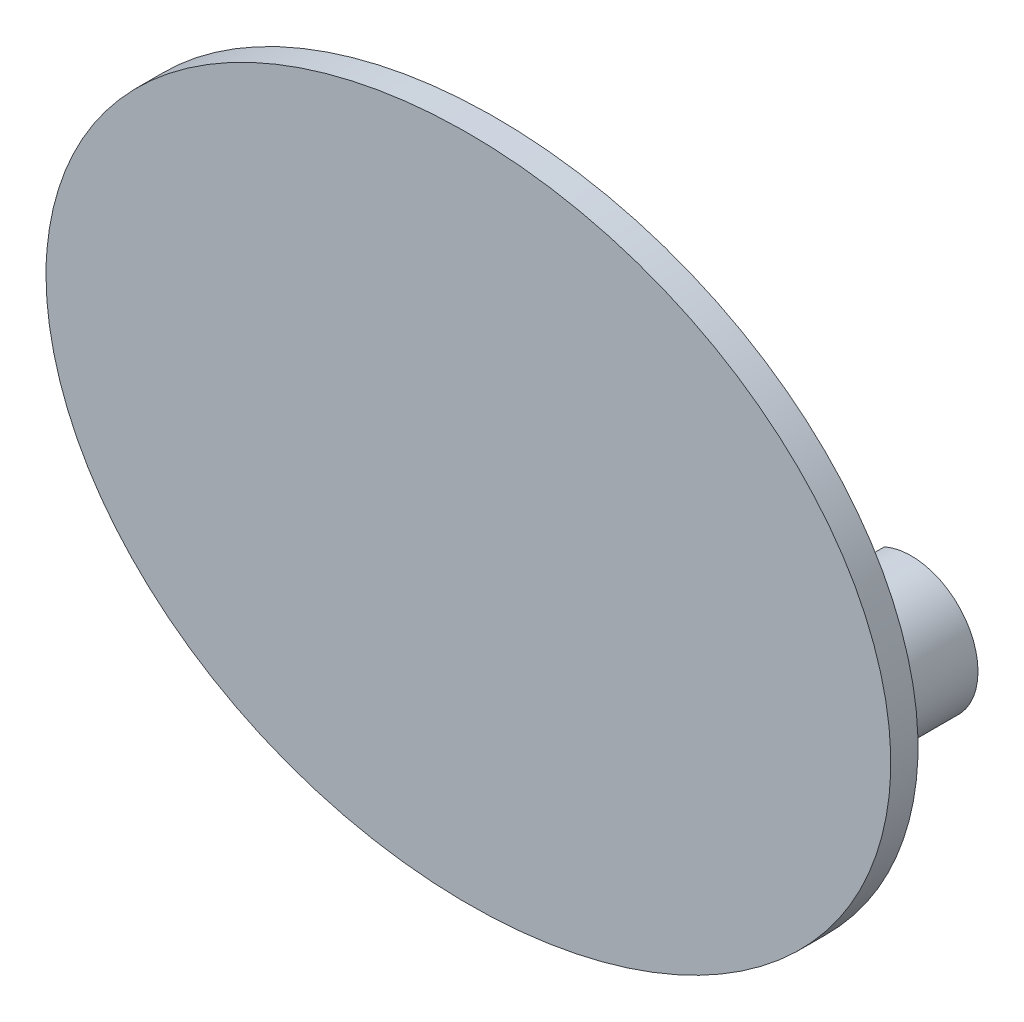
ISO-10303-21;
HEADER;
FILE_DESCRIPTION(('STEP AP214'),'2;1');
FILE_NAME('part.step','',(''),(''),'','','');
FILE_SCHEMA(('AUTOMOTIVE_DESIGN { 1 0 10303 214 1 1 1 1 }'));
ENDSEC;
DATA;
#1=APPLICATION_CONTEXT('core data for automotive mechanical design processes');
#2=APPLICATION_PROTOCOL_DEFINITION('international standard','automotive_design',2000,#1);
#3=PRODUCT_CONTEXT('',#1,'mechanical');
#4=PRODUCT('Part','Part','',(#3));
#5=PRODUCT_RELATED_PRODUCT_CATEGORY('part','',(#4));
#6=PRODUCT_DEFINITION_FORMATION('','',#4);
#7=PRODUCT_DEFINITION_CONTEXT('part definition',#1,'design');
#8=PRODUCT_DEFINITION('design','',#6,#7);
#9=PRODUCT_DEFINITION_SHAPE('','',#8);
#10=(LENGTH_UNIT() NAMED_UNIT(*) SI_UNIT(.MILLI.,.METRE.));
#11=(NAMED_UNIT(*) PLANE_ANGLE_UNIT() SI_UNIT($,.RADIAN.));
#12=(NAMED_UNIT(*) SI_UNIT($,.STERADIAN.) SOLID_ANGLE_UNIT());
#13=UNCERTAINTY_MEASURE_WITH_UNIT(LENGTH_MEASURE(1.E-05),#10,'distance_accuracy_value','');
#14=(GEOMETRIC_REPRESENTATION_CONTEXT(3) GLOBAL_UNCERTAINTY_ASSIGNED_CONTEXT((#13)) GLOBAL_UNIT_ASSIGNED_CONTEXT((#10,
#11,#12)) REPRESENTATION_CONTEXT('',''));
#15=CARTESIAN_POINT('',(0.,0.,0.));
#16=DIRECTION('',(0.,0.,1.));
#17=DIRECTION('',(1.,0.,0.));
#18=AXIS2_PLACEMENT_3D('',#15,#16,#17);
#19=CARTESIAN_POINT('',(0.,0.,-7.));
#20=DIRECTION('',(0.,0.,1.));
#21=DIRECTION('',(1.,0.,0.));
#22=AXIS2_PLACEMENT_3D('',#19,#20,#21);
#23=CYLINDRICAL_SURFACE('',#22,22.);
#24=DIRECTION('',(0.,0.,1.));
#25=VECTOR('',#24,1.);
#26=CARTESIAN_POINT('',(21.9863829787234,-0.773927330504451,-7.));
#27=LINE('',#26,#25);
#28=CARTESIAN_POINT('',(21.9863829787234,-0.773927330504452,-2.9));
#29=VERTEX_POINT('',#28);
#30=CARTESIAN_POINT('',(21.9863829787234,-0.773927330504452,0.));
#31=VERTEX_POINT('',#30);
#32=EDGE_CURVE('E312',#29,#31,#27,.T.);
#33=ORIENTED_EDGE('',*,*,#32,.F.);
#34=CARTESIAN_POINT('',(0.,0.,-2.9));
#35=DIRECTION('',(0.,0.,-1.));
#36=DIRECTION('',(-1.,0.,0.));
#37=AXIS2_PLACEMENT_3D('',#34,#35,#36);
#38=CIRCLE('',#37,22.);
#39=CARTESIAN_POINT('',(21.8080260454723,-2.89999999999999,-2.9));
#40=VERTEX_POINT('',#39);
#41=EDGE_CURVE('E244',#29,#40,#38,.T.);
#42=ORIENTED_EDGE('',*,*,#41,.T.);
#43=DIRECTION('',(0.,0.,1.));
#44=VECTOR('',#43,1.);
#45=CARTESIAN_POINT('',(21.8080260454723,-2.89999999999999,-7.));
#46=LINE('',#45,#44);
#47=CARTESIAN_POINT('',(21.8080260454723,-2.89999999999999,-5.4));
#48=VERTEX_POINT('',#47);
#49=EDGE_CURVE('E191',#48,#40,#46,.T.);
#50=ORIENTED_EDGE('',*,*,#49,.F.);
#51=CARTESIAN_POINT('',(0.,0.,-5.4));
#52=DIRECTION('',(0.,0.,-1.));
#53=DIRECTION('',(-1.,0.,0.));
#54=AXIS2_PLACEMENT_3D('',#51,#52,#53);
#55=CIRCLE('',#54,22.);
#56=CARTESIAN_POINT('',(21.9863829787234,-0.773927330504452,-5.4));
#57=VERTEX_POINT('',#56);
#58=EDGE_CURVE('E230',#57,#48,#55,.T.);
#59=ORIENTED_EDGE('',*,*,#58,.F.);
#60=CARTESIAN_POINT('',(21.9863829787234,-0.773927330504451,-7.));
#61=VERTEX_POINT('',#60);
#62=EDGE_CURVE('E308',#61,#57,#27,.T.);
#63=ORIENTED_EDGE('',*,*,#62,.F.);
#64=CARTESIAN_POINT('',(0.,0.,-7.));
#65=DIRECTION('',(0.,0.,-1.));
#66=DIRECTION('',(1.,0.,0.));
#67=AXIS2_PLACEMENT_3D('',#64,#65,#66);
#68=CIRCLE('',#67,22.);
#69=CARTESIAN_POINT('',(21.5370212765957,-4.48962298322054,-7.));
#70=VERTEX_POINT('',#69);
#71=EDGE_CURVE('E286',#61,#70,#68,.T.);
#72=ORIENTED_EDGE('',*,*,#71,.T.);
#73=DIRECTION('',(0.,0.,1.));
#74=VECTOR('',#73,1.);
#75=CARTESIAN_POINT('',(21.5370212765957,-4.48962298322054,-7.));
#76=LINE('',#75,#74);
#77=CARTESIAN_POINT('',(21.5370212765957,-4.48962298322054,0.));
#78=VERTEX_POINT('',#77);
#79=EDGE_CURVE('E299',#70,#78,#76,.T.);
#80=ORIENTED_EDGE('',*,*,#79,.T.);
#81=CARTESIAN_POINT('',(0.,0.,0.));
#82=DIRECTION('',(0.,0.,-1.));
#83=DIRECTION('',(1.,0.,0.));
#84=AXIS2_PLACEMENT_3D('',#81,#82,#83);
#85=CIRCLE('',#84,22.);
#86=EDGE_CURVE('E275',#31,#78,#85,.T.);
#87=ORIENTED_EDGE('',*,*,#86,.F.);
#88=EDGE_LOOP('',(#33,#42,#50,#59,#63,#72,#80,#87));
#89=FACE_BOUND('',#88,.T.);
#90=ADVANCED_FACE('F36',(#89),#23,.F.);
#91=CARTESIAN_POINT('',(23.5,0.,-7.));
#92=DIRECTION('',(0.,0.,1.));
#93=DIRECTION('',(1.,0.,0.));
#94=AXIS2_PLACEMENT_3D('',#91,#92,#93);
#95=CYLINDRICAL_SURFACE('',#94,1.7);
#96=DIRECTION('',(0.,0.,1.));
#97=VECTOR('',#96,1.);
#98=CARTESIAN_POINT('',(21.9863829787234,0.77392733050447,-7.));
#99=LINE('',#98,#97);
#100=CARTESIAN_POINT('',(21.9863829787234,0.77392733050447,-2.9));
#101=VERTEX_POINT('',#100);
#102=CARTESIAN_POINT('',(21.9863829787234,0.77392733050447,0.));
#103=VERTEX_POINT('',#102);
#104=EDGE_CURVE('E316',#101,#103,#99,.T.);
#105=ORIENTED_EDGE('',*,*,#104,.F.);
#106=CARTESIAN_POINT('',(23.5,0.,-2.9));
#107=DIRECTION('',(0.,0.,-1.));
#108=DIRECTION('',(-1.,0.,0.));
#109=AXIS2_PLACEMENT_3D('',#106,#107,#108);
#110=CIRCLE('',#109,1.7);
#111=EDGE_CURVE('E241',#101,#29,#110,.T.);
#112=ORIENTED_EDGE('',*,*,#111,.T.);
#113=ORIENTED_EDGE('',*,*,#32,.T.);
#114=CARTESIAN_POINT('',(23.5,0.,0.));
#115=DIRECTION('',(0.,0.,-1.));
#116=DIRECTION('',(1.,0.,0.));
#117=AXIS2_PLACEMENT_3D('',#114,#115,#116);
#118=CIRCLE('',#117,1.7);
#119=EDGE_CURVE('E290',#103,#31,#118,.T.);
#120=ORIENTED_EDGE('',*,*,#119,.F.);
#121=EDGE_LOOP('',(#105,#112,#113,#120));
#122=FACE_BOUND('',#121,.T.);
#123=ADVANCED_FACE('F397',(#122),#95,.F.);
#124=CARTESIAN_POINT('',(0.,0.,-7.));
#125=DIRECTION('',(0.,0.,1.));
#126=DIRECTION('',(1.,0.,0.));
#127=AXIS2_PLACEMENT_3D('',#124,#125,#126);
#128=CYLINDRICAL_SURFACE('',#127,22.);
#129=DIRECTION('',(0.,0.,1.));
#130=VECTOR('',#129,1.);
#131=CARTESIAN_POINT('',(21.8080260454723,2.90000000000001,-7.));
#132=LINE('',#131,#130);
#133=CARTESIAN_POINT('',(21.8080260454723,2.90000000000001,-2.9));
#134=VERTEX_POINT('',#133);
#135=CARTESIAN_POINT('',(21.8080260454723,2.90000000000001,-5.4));
#136=VERTEX_POINT('',#135);
#137=EDGE_CURVE('E246',#134,#136,#132,.F.);
#138=ORIENTED_EDGE('',*,*,#137,.F.);
#139=CARTESIAN_POINT('',(0.,0.,-2.9));
#140=DIRECTION('',(0.,0.,-1.));
#141=DIRECTION('',(-1.,0.,0.));
#142=AXIS2_PLACEMENT_3D('',#139,#140,#141);
#143=CIRCLE('',#142,22.);
#144=EDGE_CURVE('E238',#134,#101,#143,.T.);
#145=ORIENTED_EDGE('',*,*,#144,.T.);
#146=ORIENTED_EDGE('',*,*,#104,.T.);
#147=CARTESIAN_POINT('',(0.,0.,0.));
#148=DIRECTION('',(0.,0.,-1.));
#149=DIRECTION('',(1.,0.,0.));
#150=AXIS2_PLACEMENT_3D('',#147,#148,#149);
#151=CIRCLE('',#150,22.);
#152=CARTESIAN_POINT('',(21.5370212765957,4.48962298322056,0.));
#153=VERTEX_POINT('',#152);
#154=EDGE_CURVE('E303',#153,#103,#151,.T.);
#155=ORIENTED_EDGE('',*,*,#154,.F.);
#156=DIRECTION('',(0.,0.,1.));
#157=VECTOR('',#156,1.);
#158=CARTESIAN_POINT('',(21.5370212765957,4.48962298322055,-7.));
#159=LINE('',#158,#157);
#160=CARTESIAN_POINT('',(21.5370212765957,4.48962298322055,-7.));
#161=VERTEX_POINT('',#160);
#162=EDGE_CURVE('E317',#161,#153,#159,.T.);
#163=ORIENTED_EDGE('',*,*,#162,.F.);
#164=CARTESIAN_POINT('',(0.,0.,-7.));
#165=DIRECTION('',(0.,0.,-1.));
#166=DIRECTION('',(1.,0.,0.));
#167=AXIS2_PLACEMENT_3D('',#164,#165,#166);
#168=CIRCLE('',#167,22.);
#169=CARTESIAN_POINT('',(21.9863829787234,0.77392733050447,-7.));
#170=VERTEX_POINT('',#169);
#171=EDGE_CURVE('E293',#161,#170,#168,.T.);
#172=ORIENTED_EDGE('',*,*,#171,.T.);
#173=CARTESIAN_POINT('',(21.9863829787234,0.77392733050447,-5.4));
#174=VERTEX_POINT('',#173);
#175=EDGE_CURVE('E313',#170,#174,#99,.T.);
#176=ORIENTED_EDGE('',*,*,#175,.T.);
#177=CARTESIAN_POINT('',(0.,0.,-5.4));
#178=DIRECTION('',(0.,0.,-1.));
#179=DIRECTION('',(-1.,0.,0.));
#180=AXIS2_PLACEMENT_3D('',#177,#178,#179);
#181=CIRCLE('',#180,22.);
#182=EDGE_CURVE('E226',#136,#174,#181,.T.);
#183=ORIENTED_EDGE('',*,*,#182,.F.);
#184=EDGE_LOOP('',(#138,#145,#146,#155,#163,#172,#176,#183));
#185=FACE_BOUND('',#184,.T.);
#186=ADVANCED_FACE('F403',(#185),#128,.F.);
#187=CARTESIAN_POINT('',(0.,0.,-7.));
#188=DIRECTION('',(0.,0.,1.));
#189=DIRECTION('',(1.,0.,0.));
#190=AXIS2_PLACEMENT_3D('',#187,#188,#189);
#191=CYLINDRICAL_SURFACE('',#190,22.);
#192=DIRECTION('',(0.,0.,1.));
#193=VECTOR('',#192,1.);
#194=CARTESIAN_POINT('',(-21.8080260454723,-2.89999999999999,-7.));
#195=LINE('',#194,#193);
#196=CARTESIAN_POINT('',(-21.8080260454723,-2.89999999999999,-2.9));
#197=VERTEX_POINT('',#196);
#198=CARTESIAN_POINT('',(-21.8080260454723,-2.89999999999999,-5.4));
#199=VERTEX_POINT('',#198);
#200=EDGE_CURVE('E11',#197,#199,#195,.F.);
#201=ORIENTED_EDGE('',*,*,#200,.F.);
#202=CARTESIAN_POINT('',(0.,0.,-2.9));
#203=DIRECTION('',(0.,0.,-1.));
#204=DIRECTION('',(-1.,0.,0.));
#205=AXIS2_PLACEMENT_3D('',#202,#203,#204);
#206=CIRCLE('',#205,22.);
#207=CARTESIAN_POINT('',(-21.9863829787234,-0.773927330504434,-2.9));
#208=VERTEX_POINT('',#207);
#209=EDGE_CURVE('E235',#197,#208,#206,.T.);
#210=ORIENTED_EDGE('',*,*,#209,.T.);
#211=DIRECTION('',(0.,0.,1.));
#212=VECTOR('',#211,1.);
#213=CARTESIAN_POINT('',(-21.9863829787234,-0.773927330504434,-7.));
#214=LINE('',#213,#212);
#215=CARTESIAN_POINT('',(-21.9863829787234,-0.773927330504434,0.));
#216=VERTEX_POINT('',#215);
#217=EDGE_CURVE('E263',#208,#216,#214,.T.);
#218=ORIENTED_EDGE('',*,*,#217,.T.);
#219=CARTESIAN_POINT('',(0.,0.,0.));
#220=DIRECTION('',(0.,0.,-1.));
#221=DIRECTION('',(1.,0.,0.));
#222=AXIS2_PLACEMENT_3D('',#219,#220,#221);
#223=CIRCLE('',#222,22.);
#224=CARTESIAN_POINT('',(-21.5370212765958,-4.48962298322055,0.));
#225=VERTEX_POINT('',#224);
#226=EDGE_CURVE('E249',#225,#216,#223,.T.);
#227=ORIENTED_EDGE('',*,*,#226,.F.);
#228=DIRECTION('',(0.,0.,1.));
#229=VECTOR('',#228,1.);
#230=CARTESIAN_POINT('',(-21.5370212765958,-4.48962298322055,-7.));
#231=LINE('',#230,#229);
#232=CARTESIAN_POINT('',(-21.5370212765958,-4.48962298322055,-7.));
#233=VERTEX_POINT('',#232);
#234=EDGE_CURVE('E272',#233,#225,#231,.T.);
#235=ORIENTED_EDGE('',*,*,#234,.F.);
#236=CARTESIAN_POINT('',(0.,0.,-7.));
#237=DIRECTION('',(0.,0.,-1.));
#238=DIRECTION('',(1.,0.,0.));
#239=AXIS2_PLACEMENT_3D('',#236,#237,#238);
#240=CIRCLE('',#239,22.);
#241=CARTESIAN_POINT('',(-21.9863829787234,-0.773927330504434,-7.));
#242=VERTEX_POINT('',#241);
#243=EDGE_CURVE('E250',#233,#242,#240,.T.);
#244=ORIENTED_EDGE('',*,*,#243,.T.);
#245=CARTESIAN_POINT('',(-21.9863829787234,-0.773927330504434,-5.4));
#246=VERTEX_POINT('',#245);
#247=EDGE_CURVE('E283',#242,#246,#214,.T.);
#248=ORIENTED_EDGE('',*,*,#247,.T.);
#249=CARTESIAN_POINT('',(0.,0.,-5.4));
#250=DIRECTION('',(0.,0.,-1.));
#251=DIRECTION('',(-1.,0.,0.));
#252=AXIS2_PLACEMENT_3D('',#249,#250,#251);
#253=CIRCLE('',#252,22.);
#254=EDGE_CURVE('E60',#199,#246,#253,.T.);
#255=ORIENTED_EDGE('',*,*,#254,.F.);
#256=EDGE_LOOP('',(#201,#210,#218,#227,#235,#244,#248,#255));
#257=FACE_BOUND('',#256,.T.);
#258=ADVANCED_FACE('F364',(#257),#191,.F.);
#259=CARTESIAN_POINT('',(0.,0.,-7.));
#260=DIRECTION('',(0.,0.,1.));
#261=DIRECTION('',(1.,0.,0.));
#262=AXIS2_PLACEMENT_3D('',#259,#260,#261);
#263=CYLINDRICAL_SURFACE('',#262,22.);
#264=DIRECTION('',(0.,0.,1.));
#265=VECTOR('',#264,1.);
#266=CARTESIAN_POINT('',(-21.9863829787234,0.773927330504431,-7.));
#267=LINE('',#266,#265);
#268=CARTESIAN_POINT('',(-21.9863829787234,0.773927330504431,-2.9));
#269=VERTEX_POINT('',#268);
#270=CARTESIAN_POINT('',(-21.9863829787234,0.773927330504431,0.));
#271=VERTEX_POINT('',#270);
#272=EDGE_CURVE('E282',#269,#271,#267,.T.);
#273=ORIENTED_EDGE('',*,*,#272,.F.);
#274=CARTESIAN_POINT('',(0.,0.,-2.9));
#275=DIRECTION('',(0.,0.,-1.));
#276=DIRECTION('',(-1.,0.,0.));
#277=AXIS2_PLACEMENT_3D('',#274,#275,#276);
#278=CIRCLE('',#277,22.);
#279=CARTESIAN_POINT('',(-21.8080260454723,2.90000000000001,-2.9));
#280=VERTEX_POINT('',#279);
#281=EDGE_CURVE('E232',#269,#280,#278,.T.);
#282=ORIENTED_EDGE('',*,*,#281,.T.);
#283=DIRECTION('',(0.,0.,1.));
#284=VECTOR('',#283,1.);
#285=CARTESIAN_POINT('',(-21.8080260454723,2.90000000000001,-7.));
#286=LINE('',#285,#284);
#287=CARTESIAN_POINT('',(-21.8080260454723,2.90000000000001,-5.4));
#288=VERTEX_POINT('',#287);
#289=EDGE_CURVE('E45',#288,#280,#286,.T.);
#290=ORIENTED_EDGE('',*,*,#289,.F.);
#291=CARTESIAN_POINT('',(0.,0.,-5.4));
#292=DIRECTION('',(0.,0.,-1.));
#293=DIRECTION('',(-1.,0.,0.));
#294=AXIS2_PLACEMENT_3D('',#291,#292,#293);
#295=CIRCLE('',#294,22.);
#296=CARTESIAN_POINT('',(-21.9863829787234,0.773927330504431,-5.4));
#297=VERTEX_POINT('',#296);
#298=EDGE_CURVE('E219',#297,#288,#295,.T.);
#299=ORIENTED_EDGE('',*,*,#298,.F.);
#300=CARTESIAN_POINT('',(-21.9863829787234,0.773927330504431,-7.));
#301=VERTEX_POINT('',#300);
#302=EDGE_CURVE('E279',#301,#297,#267,.T.);
#303=ORIENTED_EDGE('',*,*,#302,.F.);
#304=CARTESIAN_POINT('',(0.,0.,-7.));
#305=DIRECTION('',(0.,0.,-1.));
#306=DIRECTION('',(1.,0.,0.));
#307=AXIS2_PLACEMENT_3D('',#304,#305,#306);
#308=CIRCLE('',#307,22.);
#309=CARTESIAN_POINT('',(-21.5370212765958,4.48962298322054,-7.));
#310=VERTEX_POINT('',#309);
#311=EDGE_CURVE('E257',#301,#310,#308,.T.);
#312=ORIENTED_EDGE('',*,*,#311,.T.);
#313=DIRECTION('',(0.,0.,1.));
#314=VECTOR('',#313,1.);
#315=CARTESIAN_POINT('',(-21.5370212765958,4.48962298322054,-7.));
#316=LINE('',#315,#314);
#317=CARTESIAN_POINT('',(-21.5370212765958,4.48962298322054,0.));
#318=VERTEX_POINT('',#317);
#319=EDGE_CURVE('E276',#310,#318,#316,.T.);
#320=ORIENTED_EDGE('',*,*,#319,.T.);
#321=CARTESIAN_POINT('',(0.,0.,0.));
#322=DIRECTION('',(0.,0.,-1.));
#323=DIRECTION('',(1.,0.,0.));
#324=AXIS2_PLACEMENT_3D('',#321,#322,#323);
#325=CIRCLE('',#324,22.);
#326=EDGE_CURVE('E269',#271,#318,#325,.T.);
#327=ORIENTED_EDGE('',*,*,#326,.F.);
#328=EDGE_LOOP('',(#273,#282,#290,#299,#303,#312,#320,#327));
#329=FACE_BOUND('',#328,.T.);
#330=ADVANCED_FACE('F352',(#329),#263,.F.);
#331=CARTESIAN_POINT('',(-23.5,0.,-7.));
#332=DIRECTION('',(0.,0.,1.));
#333=DIRECTION('',(1.,0.,0.));
#334=AXIS2_PLACEMENT_3D('',#331,#332,#333);
#335=CYLINDRICAL_SURFACE('',#334,1.69999999999998);
#336=ORIENTED_EDGE('',*,*,#217,.F.);
#337=CARTESIAN_POINT('',(-23.5,0.,-2.9));
#338=DIRECTION('',(0.,0.,-1.));
#339=DIRECTION('',(-1.,0.,0.));
#340=AXIS2_PLACEMENT_3D('',#337,#338,#339);
#341=CIRCLE('',#340,1.69999999999998);
#342=EDGE_CURVE('E339',#208,#269,#341,.T.);
#343=ORIENTED_EDGE('',*,*,#342,.T.);
#344=ORIENTED_EDGE('',*,*,#272,.T.);
#345=CARTESIAN_POINT('',(-23.5,0.,0.));
#346=DIRECTION('',(0.,0.,-1.));
#347=DIRECTION('',(1.,0.,0.));
#348=AXIS2_PLACEMENT_3D('',#345,#346,#347);
#349=CIRCLE('',#348,1.69999999999998);
#350=EDGE_CURVE('E266',#216,#271,#349,.T.);
#351=ORIENTED_EDGE('',*,*,#350,.F.);
#352=EDGE_LOOP('',(#336,#343,#344,#351));
#353=FACE_BOUND('',#352,.T.);
#354=ADVANCED_FACE('F357',(#353),#335,.F.);
#355=CARTESIAN_POINT('',(31.,0.,0.));
#356=DIRECTION('',(0.,0.,-1.));
#357=DIRECTION('',(-1.,0.,0.));
#358=AXIS2_PLACEMENT_3D('',#355,#356,#357);
#359=PLANE('',#358);
#360=CARTESIAN_POINT('',(-31.,0.,0.));
#361=CARTESIAN_POINT('',(-31.,-3.36634659169575,0.));
#362=CARTESIAN_POINT('',(-29.2060760589558,-10.0990397750872,0.));
#363=CARTESIAN_POINT('',(-22.0158701328041,-18.1678971581392,0.));
#364=CARTESIAN_POINT('',(-11.7947637266437,-23.318217270695,0.));
#365=CARTESIAN_POINT('',(0.,-25.0908913646525,0.));
#366=CARTESIAN_POINT('',(11.7947637266437,-23.318217270695,0.));
#367=CARTESIAN_POINT('',(22.0158701328041,-18.1678971581392,0.));
#368=CARTESIAN_POINT('',(29.2060760589558,-10.0990397750872,0.));
#369=CARTESIAN_POINT('',(31.8969619705221,0.,0.));
#370=CARTESIAN_POINT('',(29.2060760589558,10.0990397750872,0.));
#371=CARTESIAN_POINT('',(22.0158701328041,18.1678971581392,0.));
#372=CARTESIAN_POINT('',(11.7947637266437,23.318217270695,0.));
#373=CARTESIAN_POINT('',(0.,25.0908913646525,0.));
#374=CARTESIAN_POINT('',(-11.7947637266437,23.318217270695,0.));
#375=CARTESIAN_POINT('',(-22.0158701328041,18.1678971581392,0.));
#376=CARTESIAN_POINT('',(-29.2060760589558,10.0990397750872,0.));
#377=CARTESIAN_POINT('',(-31.,3.36634659169575,0.));
#378=CARTESIAN_POINT('',(-31.,0.,0.));
#379=B_SPLINE_CURVE_WITH_KNOTS('',3,(#360,#361,#362,#363,#364,#365,#366,#367,#368,#369,#370,
#371,#372,#373,#374,#375,#376,#377,#378),.UNSPECIFIED.,.T.,.F.,(4,1,1,1,1,1,1,1,1,1,1,1,1,1,1,1,
4),(0.,0.392699081698724,0.785398163397448,1.17809724509617,1.5707963267949,1.96349540849362,
2.35619449019234,2.74889357189107,3.14159265358979,3.53429173528852,3.92699081698724,
4.31968989868597,4.71238898038469,5.10508806208341,5.49778714378214,5.89048622548086,
6.28318530717959),.UNSPECIFIED.);
#380=CARTESIAN_POINT('',(-31.,0.,0.));
#381=VERTEX_POINT('',#380);
#382=EDGE_CURVE('E311',#381,#381,#379,.T.);
#383=ORIENTED_EDGE('',*,*,#382,.F.);
#384=EDGE_LOOP('',(#383));
#385=FACE_BOUND('',#384,.T.);
#386=ORIENTED_EDGE('',*,*,#86,.T.);
#387=CARTESIAN_POINT('',(23.5,0.,0.));
#388=DIRECTION('',(0.,0.,1.));
#389=DIRECTION('',(1.,0.,0.));
#390=AXIS2_PLACEMENT_3D('',#387,#388,#389);
#391=CIRCLE('',#390,4.9);
#392=EDGE_CURVE('E301',#78,#153,#391,.T.);
#393=ORIENTED_EDGE('',*,*,#392,.T.);
#394=ORIENTED_EDGE('',*,*,#154,.T.);
#395=ORIENTED_EDGE('',*,*,#119,.T.);
#396=EDGE_LOOP('',(#386,#393,#394,#395));
#397=FACE_BOUND('',#396,.T.);
#398=ORIENTED_EDGE('',*,*,#226,.T.);
#399=ORIENTED_EDGE('',*,*,#350,.T.);
#400=ORIENTED_EDGE('',*,*,#326,.T.);
#401=CARTESIAN_POINT('',(-23.5,0.,0.));
#402=DIRECTION('',(0.,0.,1.));
#403=DIRECTION('',(1.,0.,0.));
#404=AXIS2_PLACEMENT_3D('',#401,#402,#403);
#405=CIRCLE('',#404,4.9);
#406=EDGE_CURVE('E254',#318,#225,#405,.T.);
#407=ORIENTED_EDGE('',*,*,#406,.T.);
#408=EDGE_LOOP('',(#398,#399,#400,#407));
#409=FACE_BOUND('',#408,.T.);
#410=ADVANCED_FACE('F359',(#385,#397,#409),#359,.T.);
#411=CARTESIAN_POINT('',(-31.,0.,2.));
#412=CARTESIAN_POINT('',(-31.,-3.36634659169575,2.));
#413=CARTESIAN_POINT('',(-29.2060760589558,-10.0990397750872,2.));
#414=CARTESIAN_POINT('',(-22.0158701328041,-18.1678971581392,2.));
#415=CARTESIAN_POINT('',(-11.7947637266437,-23.318217270695,2.));
#416=CARTESIAN_POINT('',(0.,-25.0908913646525,2.));
#417=CARTESIAN_POINT('',(11.7947637266437,-23.318217270695,2.));
#418=CARTESIAN_POINT('',(22.0158701328041,-18.1678971581392,2.));
#419=CARTESIAN_POINT('',(29.2060760589558,-10.0990397750872,2.));
#420=CARTESIAN_POINT('',(31.8969619705221,0.,2.));
#421=CARTESIAN_POINT('',(29.2060760589558,10.0990397750872,2.));
#422=CARTESIAN_POINT('',(22.0158701328041,18.1678971581392,2.));
#423=CARTESIAN_POINT('',(11.7947637266437,23.318217270695,2.));
#424=CARTESIAN_POINT('',(0.,25.0908913646525,2.));
#425=CARTESIAN_POINT('',(-11.7947637266437,23.318217270695,2.));
#426=CARTESIAN_POINT('',(-22.0158701328041,18.1678971581392,2.));
#427=CARTESIAN_POINT('',(-29.2060760589558,10.0990397750872,2.));
#428=CARTESIAN_POINT('',(-31.,3.36634659169575,2.));
#429=CARTESIAN_POINT('',(-31.,0.,2.));
#430=B_SPLINE_CURVE_WITH_KNOTS('',3,(#411,#412,#413,#414,#415,#416,#417,#418,#419,#420,#421,
#422,#423,#424,#425,#426,#427,#428,#429),.UNSPECIFIED.,.T.,.F.,(4,1,1,1,1,1,1,1,1,1,1,1,1,1,1,1,
4),(0.,0.392699081698724,0.785398163397448,1.17809724509617,1.5707963267949,1.96349540849362,
2.35619449019234,2.74889357189107,3.14159265358979,3.53429173528852,3.92699081698724,
4.31968989868597,4.71238898038469,5.10508806208341,5.49778714378214,5.89048622548086,
6.28318530717959),.UNSPECIFIED.);
#431=DIRECTION('',(0.,0.,-1.));
#432=VECTOR('',#431,1.);
#433=SURFACE_OF_LINEAR_EXTRUSION('',#430,#432);
#434=CARTESIAN_POINT('',(-31.,0.,2.));
#435=VERTEX_POINT('',#434);
#436=EDGE_CURVE('E321',#435,#435,#430,.T.);
#437=ORIENTED_EDGE('',*,*,#436,.F.);
#438=EDGE_LOOP('',(#437));
#439=FACE_BOUND('',#438,.T.);
#440=ORIENTED_EDGE('',*,*,#382,.T.);
#441=EDGE_LOOP('',(#440));
#442=FACE_BOUND('',#441,.T.);
#443=ADVANCED_FACE('F38',(#439,#442),#433,.F.);
#444=CARTESIAN_POINT('',(31.,0.,2.));
#445=DIRECTION('',(0.,0.,-1.));
#446=DIRECTION('',(-1.,0.,0.));
#447=AXIS2_PLACEMENT_3D('',#444,#445,#446);
#448=PLANE('',#447);
#449=ORIENTED_EDGE('',*,*,#436,.T.);
#450=EDGE_LOOP('',(#449));
#451=FACE_BOUND('',#450,.T.);
#452=ADVANCED_FACE('F411',(#451),#448,.F.);
#453=CARTESIAN_POINT('',(23.5,0.,-5.4));
#454=DIRECTION('',(0.,0.,-1.));
#455=DIRECTION('',(-1.,0.,0.));
#456=AXIS2_PLACEMENT_3D('',#453,#454,#455);
#457=CIRCLE('',#456,1.7);
#458=EDGE_CURVE('E228',#174,#57,#457,.T.);
#459=ORIENTED_EDGE('',*,*,#458,.F.);
#460=ORIENTED_EDGE('',*,*,#175,.F.);
#461=CARTESIAN_POINT('',(23.5,0.,-7.));
#462=DIRECTION('',(0.,0.,-1.));
#463=DIRECTION('',(1.,0.,0.));
#464=AXIS2_PLACEMENT_3D('',#461,#462,#463);
#465=CIRCLE('',#464,1.7);
#466=EDGE_CURVE('E296',#170,#61,#465,.T.);
#467=ORIENTED_EDGE('',*,*,#466,.T.);
#468=ORIENTED_EDGE('',*,*,#62,.T.);
#469=EDGE_LOOP('',(#459,#460,#467,#468));
#470=FACE_BOUND('',#469,.T.);
#471=ADVANCED_FACE('F406',(#470),#95,.F.);
#472=CARTESIAN_POINT('',(23.5,0.,-7.));
#473=DIRECTION('',(0.,0.,1.));
#474=DIRECTION('',(1.,0.,0.));
#475=AXIS2_PLACEMENT_3D('',#472,#473,#474);
#476=CYLINDRICAL_SURFACE('',#475,4.9);
#477=ORIENTED_EDGE('',*,*,#392,.F.);
#478=ORIENTED_EDGE('',*,*,#79,.F.);
#479=CARTESIAN_POINT('',(23.5,0.,-7.));
#480=DIRECTION('',(0.,0.,1.));
#481=DIRECTION('',(1.,0.,0.));
#482=AXIS2_PLACEMENT_3D('',#479,#480,#481);
#483=CIRCLE('',#482,4.9);
#484=EDGE_CURVE('E289',#70,#161,#483,.T.);
#485=ORIENTED_EDGE('',*,*,#484,.T.);
#486=ORIENTED_EDGE('',*,*,#162,.T.);
#487=EDGE_LOOP('',(#477,#478,#485,#486));
#488=FACE_BOUND('',#487,.T.);
#489=ADVANCED_FACE('F391',(#488),#476,.T.);
#490=CARTESIAN_POINT('',(11.75,0.,-7.));
#491=DIRECTION('',(0.,0.,1.));
#492=DIRECTION('',(1.,0.,0.));
#493=AXIS2_PLACEMENT_3D('',#490,#491,#492);
#494=PLANE('',#493);
#495=ORIENTED_EDGE('',*,*,#71,.F.);
#496=ORIENTED_EDGE('',*,*,#466,.F.);
#497=ORIENTED_EDGE('',*,*,#171,.F.);
#498=ORIENTED_EDGE('',*,*,#484,.F.);
#499=EDGE_LOOP('',(#495,#496,#497,#498));
#500=FACE_BOUND('',#499,.T.);
#501=ADVANCED_FACE('F384',(#500),#494,.F.);
#502=CARTESIAN_POINT('',(-23.5,0.,-7.));
#503=DIRECTION('',(0.,0.,1.));
#504=DIRECTION('',(1.,0.,0.));
#505=AXIS2_PLACEMENT_3D('',#502,#503,#504);
#506=CYLINDRICAL_SURFACE('',#505,4.9);
#507=ORIENTED_EDGE('',*,*,#406,.F.);
#508=ORIENTED_EDGE('',*,*,#319,.F.);
#509=CARTESIAN_POINT('',(-23.5,0.,-7.));
#510=DIRECTION('',(0.,0.,1.));
#511=DIRECTION('',(1.,0.,0.));
#512=AXIS2_PLACEMENT_3D('',#509,#510,#511);
#513=CIRCLE('',#512,4.9);
#514=EDGE_CURVE('E260',#310,#233,#513,.T.);
#515=ORIENTED_EDGE('',*,*,#514,.T.);
#516=ORIENTED_EDGE('',*,*,#234,.T.);
#517=EDGE_LOOP('',(#507,#508,#515,#516));
#518=FACE_BOUND('',#517,.T.);
#519=ADVANCED_FACE('F382',(#518),#506,.T.);
#520=CARTESIAN_POINT('',(-23.5,0.,-5.4));
#521=DIRECTION('',(0.,0.,-1.));
#522=DIRECTION('',(-1.,0.,0.));
#523=AXIS2_PLACEMENT_3D('',#520,#521,#522);
#524=CIRCLE('',#523,1.69999999999998);
#525=EDGE_CURVE('E327',#246,#297,#524,.T.);
#526=ORIENTED_EDGE('',*,*,#525,.F.);
#527=ORIENTED_EDGE('',*,*,#247,.F.);
#528=CARTESIAN_POINT('',(-23.5,0.,-7.));
#529=DIRECTION('',(0.,0.,-1.));
#530=DIRECTION('',(1.,0.,0.));
#531=AXIS2_PLACEMENT_3D('',#528,#529,#530);
#532=CIRCLE('',#531,1.69999999999998);
#533=EDGE_CURVE('E253',#242,#301,#532,.T.);
#534=ORIENTED_EDGE('',*,*,#533,.T.);
#535=ORIENTED_EDGE('',*,*,#302,.T.);
#536=EDGE_LOOP('',(#526,#527,#534,#535));
#537=FACE_BOUND('',#536,.T.);
#538=ADVANCED_FACE('F376',(#537),#335,.F.);
#539=CARTESIAN_POINT('',(-11.75,0.,-7.));
#540=DIRECTION('',(0.,0.,1.));
#541=DIRECTION('',(1.,0.,0.));
#542=AXIS2_PLACEMENT_3D('',#539,#540,#541);
#543=PLANE('',#542);
#544=ORIENTED_EDGE('',*,*,#243,.F.);
#545=ORIENTED_EDGE('',*,*,#514,.F.);
#546=ORIENTED_EDGE('',*,*,#311,.F.);
#547=ORIENTED_EDGE('',*,*,#533,.F.);
#548=EDGE_LOOP('',(#544,#545,#546,#547));
#549=FACE_BOUND('',#548,.T.);
#550=ADVANCED_FACE('F379',(#549),#543,.F.);
#551=CARTESIAN_POINT('',(-24.5,0.,-2.9));
#552=DIRECTION('',(0.,0.,-1.));
#553=DIRECTION('',(-1.,0.,0.));
#554=AXIS2_PLACEMENT_3D('',#551,#552,#553);
#555=CYLINDRICAL_SURFACE('',#554,2.9);
#556=CARTESIAN_POINT('',(-24.5,0.,-5.4));
#557=DIRECTION('',(0.,0.,-1.));
#558=DIRECTION('',(-1.,0.,0.));
#559=AXIS2_PLACEMENT_3D('',#556,#557,#558);
#560=CIRCLE('',#559,2.9);
#561=CARTESIAN_POINT('',(-24.5,-2.89999999999999,-5.4));
#562=VERTEX_POINT('',#561);
#563=CARTESIAN_POINT('',(-24.5,2.90000000000001,-5.4));
#564=VERTEX_POINT('',#563);
#565=EDGE_CURVE('E214',#562,#564,#560,.T.);
#566=ORIENTED_EDGE('',*,*,#565,.T.);
#567=DIRECTION('',(0.,0.,-1.));
#568=VECTOR('',#567,1.);
#569=CARTESIAN_POINT('',(-24.5,2.90000000000001,-2.9));
#570=LINE('',#569,#568);
#571=CARTESIAN_POINT('',(-24.5,2.90000000000001,-2.9));
#572=VERTEX_POINT('',#571);
#573=EDGE_CURVE('E220',#572,#564,#570,.T.);
#574=ORIENTED_EDGE('',*,*,#573,.F.);
#575=CARTESIAN_POINT('',(-24.5,0.,-2.9));
#576=DIRECTION('',(0.,0.,-1.));
#577=DIRECTION('',(-1.,0.,0.));
#578=AXIS2_PLACEMENT_3D('',#575,#576,#577);
#579=CIRCLE('',#578,2.9);
#580=CARTESIAN_POINT('',(-24.5,-2.89999999999999,-2.9));
#581=VERTEX_POINT('',#580);
#582=EDGE_CURVE('E194',#581,#572,#579,.T.);
#583=ORIENTED_EDGE('',*,*,#582,.F.);
#584=DIRECTION('',(0.,0.,-1.));
#585=VECTOR('',#584,1.);
#586=CARTESIAN_POINT('',(-24.5,-2.89999999999999,-2.9));
#587=LINE('',#586,#585);
#588=EDGE_CURVE('E184',#581,#562,#587,.T.);
#589=ORIENTED_EDGE('',*,*,#588,.T.);
#590=EDGE_LOOP('',(#566,#574,#583,#589));
#591=FACE_BOUND('',#590,.T.);
#592=ADVANCED_FACE('F372',(#591),#555,.F.);
#593=CARTESIAN_POINT('',(24.5,0.,-2.9));
#594=DIRECTION('',(0.,0.,-1.));
#595=DIRECTION('',(-1.,0.,0.));
#596=AXIS2_PLACEMENT_3D('',#593,#594,#595);
#597=PLANE('',#596);
#598=DIRECTION('',(-1.,0.,0.));
#599=VECTOR('',#598,1.);
#600=CARTESIAN_POINT('',(24.5,-2.89999999999999,-2.9));
#601=LINE('',#600,#599);
#602=EDGE_CURVE('E195',#197,#581,#601,.T.);
#603=ORIENTED_EDGE('',*,*,#602,.T.);
#604=ORIENTED_EDGE('',*,*,#582,.T.);
#605=DIRECTION('',(1.,0.,0.));
#606=VECTOR('',#605,1.);
#607=CARTESIAN_POINT('',(24.5,2.90000000000001,-2.9));
#608=LINE('',#607,#606);
#609=EDGE_CURVE('E185',#572,#280,#608,.T.);
#610=ORIENTED_EDGE('',*,*,#609,.T.);
#611=ORIENTED_EDGE('',*,*,#281,.F.);
#612=ORIENTED_EDGE('',*,*,#342,.F.);
#613=ORIENTED_EDGE('',*,*,#209,.F.);
#614=EDGE_LOOP('',(#603,#604,#610,#611,#612,#613));
#615=FACE_BOUND('',#614,.T.);
#616=ADVANCED_FACE('F349',(#615),#597,.T.);
#617=CARTESIAN_POINT('',(24.5,0.,-5.4));
#618=DIRECTION('',(0.,0.,-1.));
#619=DIRECTION('',(-1.,0.,0.));
#620=AXIS2_PLACEMENT_3D('',#617,#618,#619);
#621=PLANE('',#620);
#622=ORIENTED_EDGE('',*,*,#254,.T.);
#623=ORIENTED_EDGE('',*,*,#525,.T.);
#624=ORIENTED_EDGE('',*,*,#298,.T.);
#625=DIRECTION('',(1.,0.,0.));
#626=VECTOR('',#625,1.);
#627=CARTESIAN_POINT('',(24.5,2.90000000000001,-5.4));
#628=LINE('',#627,#626);
#629=EDGE_CURVE('E201',#564,#288,#628,.T.);
#630=ORIENTED_EDGE('',*,*,#629,.F.);
#631=ORIENTED_EDGE('',*,*,#565,.F.);
#632=DIRECTION('',(-1.,0.,0.));
#633=VECTOR('',#632,1.);
#634=CARTESIAN_POINT('',(24.5,-2.89999999999999,-5.4));
#635=LINE('',#634,#633);
#636=EDGE_CURVE('E211',#199,#562,#635,.T.);
#637=ORIENTED_EDGE('',*,*,#636,.F.);
#638=EDGE_LOOP('',(#622,#623,#624,#630,#631,#637));
#639=FACE_BOUND('',#638,.T.);
#640=ADVANCED_FACE('F373',(#639),#621,.F.);
#641=CARTESIAN_POINT('',(24.5,2.90000000000001,-2.9));
#642=DIRECTION('',(0.,1.,0.));
#643=DIRECTION('',(0.,0.,1.));
#644=AXIS2_PLACEMENT_3D('',#641,#642,#643);
#645=PLANE('',#644);
#646=ORIENTED_EDGE('',*,*,#289,.T.);
#647=ORIENTED_EDGE('',*,*,#609,.F.);
#648=ORIENTED_EDGE('',*,*,#573,.T.);
#649=ORIENTED_EDGE('',*,*,#629,.T.);
#650=EDGE_LOOP('',(#646,#647,#648,#649));
#651=FACE_BOUND('',#650,.T.);
#652=ADVANCED_FACE('F344',(#651),#645,.F.);
#653=CARTESIAN_POINT('',(24.5,-2.89999999999999,-2.9));
#654=DIRECTION('',(0.,-1.,0.));
#655=DIRECTION('',(0.,0.,-1.));
#656=AXIS2_PLACEMENT_3D('',#653,#654,#655);
#657=PLANE('',#656);
#658=ORIENTED_EDGE('',*,*,#200,.T.);
#659=ORIENTED_EDGE('',*,*,#636,.T.);
#660=ORIENTED_EDGE('',*,*,#588,.F.);
#661=ORIENTED_EDGE('',*,*,#602,.F.);
#662=EDGE_LOOP('',(#658,#659,#660,#661));
#663=FACE_BOUND('',#662,.T.);
#664=ADVANCED_FACE('F369',(#663),#657,.F.);
#665=ORIENTED_EDGE('',*,*,#49,.T.);
#666=CARTESIAN_POINT('',(24.5,-2.89999999999999,-2.9));
#667=VERTEX_POINT('',#666);
#668=EDGE_CURVE('E188',#667,#40,#601,.T.);
#669=ORIENTED_EDGE('',*,*,#668,.F.);
#670=DIRECTION('',(0.,0.,-1.));
#671=VECTOR('',#670,1.);
#672=CARTESIAN_POINT('',(24.5,-2.89999999999999,-2.9));
#673=LINE('',#672,#671);
#674=CARTESIAN_POINT('',(24.5,-2.89999999999999,-5.4));
#675=VERTEX_POINT('',#674);
#676=EDGE_CURVE('E174',#667,#675,#673,.T.);
#677=ORIENTED_EDGE('',*,*,#676,.T.);
#678=EDGE_CURVE('E212',#675,#48,#635,.T.);
#679=ORIENTED_EDGE('',*,*,#678,.T.);
#680=EDGE_LOOP('',(#665,#669,#677,#679));
#681=FACE_BOUND('',#680,.T.);
#682=ADVANCED_FACE('F189',(#681),#657,.F.);
#683=ORIENTED_EDGE('',*,*,#137,.T.);
#684=CARTESIAN_POINT('',(24.5,2.90000000000001,-5.4));
#685=VERTEX_POINT('',#684);
#686=EDGE_CURVE('E52',#136,#685,#628,.T.);
#687=ORIENTED_EDGE('',*,*,#686,.T.);
#688=DIRECTION('',(0.,0.,-1.));
#689=VECTOR('',#688,1.);
#690=CARTESIAN_POINT('',(24.5,2.90000000000001,-2.9));
#691=LINE('',#690,#689);
#692=CARTESIAN_POINT('',(24.5,2.90000000000001,-2.9));
#693=VERTEX_POINT('',#692);
#694=EDGE_CURVE('E217',#693,#685,#691,.T.);
#695=ORIENTED_EDGE('',*,*,#694,.F.);
#696=EDGE_CURVE('E199',#134,#693,#608,.T.);
#697=ORIENTED_EDGE('',*,*,#696,.F.);
#698=EDGE_LOOP('',(#683,#687,#695,#697));
#699=FACE_BOUND('',#698,.T.);
#700=ADVANCED_FACE('F437',(#699),#645,.F.);
#701=ORIENTED_EDGE('',*,*,#111,.F.);
#702=ORIENTED_EDGE('',*,*,#144,.F.);
#703=ORIENTED_EDGE('',*,*,#696,.T.);
#704=CARTESIAN_POINT('',(24.5,0.,-2.9));
#705=DIRECTION('',(0.,0.,-1.));
#706=DIRECTION('',(-1.,0.,0.));
#707=AXIS2_PLACEMENT_3D('',#704,#705,#706);
#708=CIRCLE('',#707,2.9);
#709=EDGE_CURVE('E179',#693,#667,#708,.T.);
#710=ORIENTED_EDGE('',*,*,#709,.T.);
#711=ORIENTED_EDGE('',*,*,#668,.T.);
#712=ORIENTED_EDGE('',*,*,#41,.F.);
#713=EDGE_LOOP('',(#701,#702,#703,#710,#711,#712));
#714=FACE_BOUND('',#713,.T.);
#715=ADVANCED_FACE('F197',(#714),#597,.T.);
#716=ORIENTED_EDGE('',*,*,#58,.T.);
#717=ORIENTED_EDGE('',*,*,#678,.F.);
#718=CARTESIAN_POINT('',(24.5,0.,-5.4));
#719=DIRECTION('',(0.,0.,-1.));
#720=DIRECTION('',(-1.,0.,0.));
#721=AXIS2_PLACEMENT_3D('',#718,#719,#720);
#722=CIRCLE('',#721,2.9);
#723=EDGE_CURVE('E180',#685,#675,#722,.T.);
#724=ORIENTED_EDGE('',*,*,#723,.F.);
#725=ORIENTED_EDGE('',*,*,#686,.F.);
#726=ORIENTED_EDGE('',*,*,#182,.T.);
#727=ORIENTED_EDGE('',*,*,#458,.T.);
#728=EDGE_LOOP('',(#716,#717,#724,#725,#726,#727));
#729=FACE_BOUND('',#728,.T.);
#730=ADVANCED_FACE('F438',(#729),#621,.F.);
#731=CARTESIAN_POINT('',(24.5,0.,-2.9));
#732=DIRECTION('',(0.,0.,-1.));
#733=DIRECTION('',(-1.,0.,0.));
#734=AXIS2_PLACEMENT_3D('',#731,#732,#733);
#735=CYLINDRICAL_SURFACE('',#734,2.9);
#736=ORIENTED_EDGE('',*,*,#723,.T.);
#737=ORIENTED_EDGE('',*,*,#676,.F.);
#738=ORIENTED_EDGE('',*,*,#709,.F.);
#739=ORIENTED_EDGE('',*,*,#694,.T.);
#740=EDGE_LOOP('',(#736,#737,#738,#739));
#741=FACE_BOUND('',#740,.T.);
#742=ADVANCED_FACE('F176',(#741),#735,.F.);
#743=CLOSED_SHELL('',(#90,#123,#186,#258,#330,#354,#410,#443,#452,#471,#489,#501,#519,#538,#550,
#592,#616,#640,#652,#664,#682,#700,#715,#730,#742));
#744=MANIFOLD_SOLID_BREP('B2',#743);
#745=ADVANCED_BREP_SHAPE_REPRESENTATION('',(#18,#744),#14);
#746=SHAPE_DEFINITION_REPRESENTATION(#9,#745);
ENDSEC;
END-ISO-10303-21;
